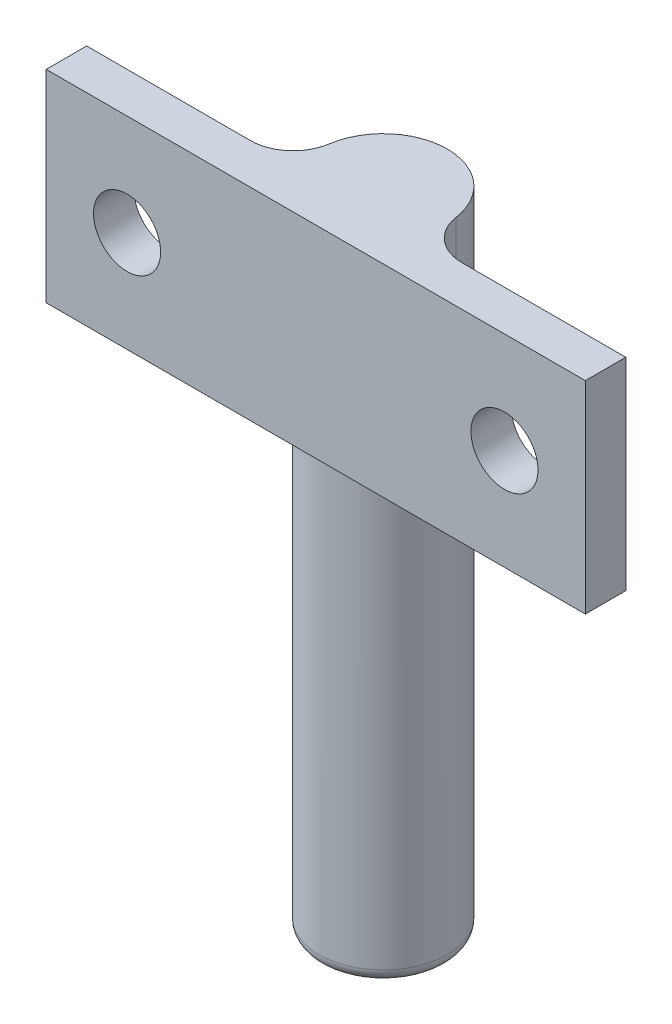
ISO-10303-21;
HEADER;
FILE_DESCRIPTION(('STEP AP214'),'2;1');
FILE_NAME('part.step','',(''),(''),'','','');
FILE_SCHEMA(('AUTOMOTIVE_DESIGN { 1 0 10303 214 1 1 1 1 }'));
ENDSEC;
DATA;
#1=APPLICATION_CONTEXT('core data for automotive mechanical design processes');
#2=APPLICATION_PROTOCOL_DEFINITION('international standard','automotive_design',2000,#1);
#3=PRODUCT_CONTEXT('',#1,'mechanical');
#4=PRODUCT('Part','Part','',(#3));
#5=PRODUCT_RELATED_PRODUCT_CATEGORY('part','',(#4));
#6=PRODUCT_DEFINITION_FORMATION('','',#4);
#7=PRODUCT_DEFINITION_CONTEXT('part definition',#1,'design');
#8=PRODUCT_DEFINITION('design','',#6,#7);
#9=PRODUCT_DEFINITION_SHAPE('','',#8);
#10=(LENGTH_UNIT() NAMED_UNIT(*) SI_UNIT(.MILLI.,.METRE.));
#11=(NAMED_UNIT(*) PLANE_ANGLE_UNIT() SI_UNIT($,.RADIAN.));
#12=(NAMED_UNIT(*) SI_UNIT($,.STERADIAN.) SOLID_ANGLE_UNIT());
#13=UNCERTAINTY_MEASURE_WITH_UNIT(LENGTH_MEASURE(1.E-05),#10,'distance_accuracy_value','');
#14=(GEOMETRIC_REPRESENTATION_CONTEXT(3) GLOBAL_UNCERTAINTY_ASSIGNED_CONTEXT((#13)) GLOBAL_UNIT_ASSIGNED_CONTEXT((#10,
#11,#12)) REPRESENTATION_CONTEXT('',''));
#15=CARTESIAN_POINT('',(0.,0.,0.));
#16=DIRECTION('',(0.,0.,1.));
#17=DIRECTION('',(1.,0.,0.));
#18=AXIS2_PLACEMENT_3D('',#15,#16,#17);
#19=CARTESIAN_POINT('',(0.,0.,-5.));
#20=DIRECTION('',(0.,1.,0.));
#21=DIRECTION('',(0.,0.,1.));
#22=AXIS2_PLACEMENT_3D('',#19,#20,#21);
#23=PLANE('',#22);
#24=CARTESIAN_POINT('',(0.,0.,-5.));
#25=DIRECTION('',(0.,-1.,0.));
#26=DIRECTION('',(0.,0.,-1.));
#27=AXIS2_PLACEMENT_3D('',#24,#25,#26);
#28=CIRCLE('',#27,4.7625);
#29=CARTESIAN_POINT('',(4.71002985659327,0.,-5.705));
#30=VERTEX_POINT('',#29);
#31=CARTESIAN_POINT('',(-4.71002985659327,0.,-5.705));
#32=VERTEX_POINT('',#31);
#33=EDGE_CURVE('E97',#30,#32,#28,.T.);
#34=ORIENTED_EDGE('',*,*,#33,.F.);
#35=CARTESIAN_POINT('',(7.85004976098878,0.,-6.17500000000001));
#36=DIRECTION('',(0.,1.,0.));
#37=DIRECTION('',(0.,0.,1.));
#38=AXIS2_PLACEMENT_3D('',#35,#36,#37);
#39=CIRCLE('',#38,3.175);
#40=CARTESIAN_POINT('',(7.85004976098878,0.,-3.00000000000001));
#41=VERTEX_POINT('',#40);
#42=EDGE_CURVE('E55',#30,#41,#39,.T.);
#43=ORIENTED_EDGE('',*,*,#42,.T.);
#44=DIRECTION('',(-1.,0.,0.));
#45=VECTOR('',#44,1.);
#46=CARTESIAN_POINT('',(4.32219923765668,0.,-3.00000000000001));
#47=LINE('',#46,#45);
#48=CARTESIAN_POINT('',(20.,0.,-3.00000000000001));
#49=VERTEX_POINT('',#48);
#50=EDGE_CURVE('E163',#49,#41,#47,.T.);
#51=ORIENTED_EDGE('',*,*,#50,.F.);
#52=DIRECTION('',(0.,0.,-1.));
#53=VECTOR('',#52,1.);
#54=CARTESIAN_POINT('',(20.,0.,-3.00000000000001));
#55=LINE('',#54,#53);
#56=CARTESIAN_POINT('',(20.,0.,0.));
#57=VERTEX_POINT('',#56);
#58=EDGE_CURVE('E161',#57,#49,#55,.T.);
#59=ORIENTED_EDGE('',*,*,#58,.F.);
#60=DIRECTION('',(1.,0.,0.));
#61=VECTOR('',#60,1.);
#62=CARTESIAN_POINT('',(-20.,0.,0.));
#63=LINE('',#62,#61);
#64=CARTESIAN_POINT('',(-20.,0.,0.));
#65=VERTEX_POINT('',#64);
#66=EDGE_CURVE('E159',#65,#57,#63,.T.);
#67=ORIENTED_EDGE('',*,*,#66,.F.);
#68=DIRECTION('',(0.,0.,1.));
#69=VECTOR('',#68,1.);
#70=CARTESIAN_POINT('',(-20.,0.,-3.));
#71=LINE('',#70,#69);
#72=CARTESIAN_POINT('',(-20.,0.,-3.));
#73=VERTEX_POINT('',#72);
#74=EDGE_CURVE('E103',#73,#65,#71,.T.);
#75=ORIENTED_EDGE('',*,*,#74,.F.);
#76=DIRECTION('',(-1.,0.,0.));
#77=VECTOR('',#76,1.);
#78=CARTESIAN_POINT('',(-20.,0.,-3.));
#79=LINE('',#78,#77);
#80=CARTESIAN_POINT('',(-7.85004976098878,0.,-3.));
#81=VERTEX_POINT('',#80);
#82=EDGE_CURVE('E147',#81,#73,#79,.T.);
#83=ORIENTED_EDGE('',*,*,#82,.F.);
#84=CARTESIAN_POINT('',(-7.85004976098878,0.,-6.175));
#85=DIRECTION('',(0.,1.,0.));
#86=DIRECTION('',(0.,0.,1.));
#87=AXIS2_PLACEMENT_3D('',#84,#85,#86);
#88=CIRCLE('',#87,3.175);
#89=EDGE_CURVE('E99',#81,#32,#88,.T.);
#90=ORIENTED_EDGE('',*,*,#89,.T.);
#91=EDGE_LOOP('',(#34,#43,#51,#59,#67,#75,#83,#90));
#92=FACE_BOUND('',#91,.T.);
#93=ADVANCED_FACE('F32',(#92),#23,.F.);
#94=CARTESIAN_POINT('',(-20.,15.,-3.));
#95=DIRECTION('',(1.,0.,0.));
#96=DIRECTION('',(0.,0.,-1.));
#97=AXIS2_PLACEMENT_3D('',#94,#95,#96);
#98=PLANE('',#97);
#99=ORIENTED_EDGE('',*,*,#74,.T.);
#100=DIRECTION('',(0.,-1.,0.));
#101=VECTOR('',#100,1.);
#102=CARTESIAN_POINT('',(-20.,15.,0.));
#103=LINE('',#102,#101);
#104=CARTESIAN_POINT('',(-20.,15.,0.));
#105=VERTEX_POINT('',#104);
#106=EDGE_CURVE('E123',#105,#65,#103,.T.);
#107=ORIENTED_EDGE('',*,*,#106,.F.);
#108=DIRECTION('',(0.,0.,1.));
#109=VECTOR('',#108,1.);
#110=CARTESIAN_POINT('',(-20.,15.,-3.));
#111=LINE('',#110,#109);
#112=CARTESIAN_POINT('',(-20.,15.,-3.));
#113=VERTEX_POINT('',#112);
#114=EDGE_CURVE('E143',#113,#105,#111,.T.);
#115=ORIENTED_EDGE('',*,*,#114,.F.);
#116=DIRECTION('',(0.,-1.,0.));
#117=VECTOR('',#116,1.);
#118=CARTESIAN_POINT('',(-20.,15.,-3.));
#119=LINE('',#118,#117);
#120=EDGE_CURVE('E156',#113,#73,#119,.T.);
#121=ORIENTED_EDGE('',*,*,#120,.T.);
#122=EDGE_LOOP('',(#99,#107,#115,#121));
#123=FACE_BOUND('',#122,.T.);
#124=ADVANCED_FACE('F195',(#123),#98,.F.);
#125=CARTESIAN_POINT('',(-20.,15.,0.));
#126=DIRECTION('',(0.,0.,-1.));
#127=DIRECTION('',(-1.,0.,0.));
#128=AXIS2_PLACEMENT_3D('',#125,#126,#127);
#129=PLANE('',#128);
#130=CARTESIAN_POINT('',(-14.,7.5,0.));
#131=DIRECTION('',(0.,0.,-1.));
#132=DIRECTION('',(-1.,0.,0.));
#133=AXIS2_PLACEMENT_3D('',#130,#131,#132);
#134=CIRCLE('',#133,2.4892);
#135=CARTESIAN_POINT('',(-16.4892,7.5,0.));
#136=VERTEX_POINT('',#135);
#137=EDGE_CURVE('E225',#136,#136,#134,.T.);
#138=ORIENTED_EDGE('',*,*,#137,.T.);
#139=EDGE_LOOP('',(#138));
#140=FACE_BOUND('',#139,.T.);
#141=CARTESIAN_POINT('',(14.,7.5,0.));
#142=DIRECTION('',(0.,0.,-1.));
#143=DIRECTION('',(-1.,0.,0.));
#144=AXIS2_PLACEMENT_3D('',#141,#142,#143);
#145=CIRCLE('',#144,2.4892);
#146=CARTESIAN_POINT('',(11.5108,7.5,0.));
#147=VERTEX_POINT('',#146);
#148=EDGE_CURVE('E104',#147,#147,#145,.T.);
#149=ORIENTED_EDGE('',*,*,#148,.T.);
#150=EDGE_LOOP('',(#149));
#151=FACE_BOUND('',#150,.T.);
#152=ORIENTED_EDGE('',*,*,#66,.T.);
#153=DIRECTION('',(0.,-1.,0.));
#154=VECTOR('',#153,1.);
#155=CARTESIAN_POINT('',(20.,15.,0.));
#156=LINE('',#155,#154);
#157=CARTESIAN_POINT('',(20.,15.,0.));
#158=VERTEX_POINT('',#157);
#159=EDGE_CURVE('E171',#158,#57,#156,.T.);
#160=ORIENTED_EDGE('',*,*,#159,.F.);
#161=DIRECTION('',(1.,0.,0.));
#162=VECTOR('',#161,1.);
#163=CARTESIAN_POINT('',(-20.,15.,0.));
#164=LINE('',#163,#162);
#165=EDGE_CURVE('E146',#105,#158,#164,.T.);
#166=ORIENTED_EDGE('',*,*,#165,.F.);
#167=ORIENTED_EDGE('',*,*,#106,.T.);
#168=EDGE_LOOP('',(#152,#160,#166,#167));
#169=FACE_BOUND('',#168,.T.);
#170=ADVANCED_FACE('F200',(#140,#151,#169),#129,.F.);
#171=CARTESIAN_POINT('',(20.,15.,-3.00000000000001));
#172=DIRECTION('',(-1.,0.,0.));
#173=DIRECTION('',(0.,0.,1.));
#174=AXIS2_PLACEMENT_3D('',#171,#172,#173);
#175=PLANE('',#174);
#176=ORIENTED_EDGE('',*,*,#58,.T.);
#177=DIRECTION('',(0.,-1.,0.));
#178=VECTOR('',#177,1.);
#179=CARTESIAN_POINT('',(20.,15.,-3.00000000000001));
#180=LINE('',#179,#178);
#181=CARTESIAN_POINT('',(20.,15.,-3.00000000000001));
#182=VERTEX_POINT('',#181);
#183=EDGE_CURVE('E168',#182,#49,#180,.T.);
#184=ORIENTED_EDGE('',*,*,#183,.F.);
#185=DIRECTION('',(0.,0.,-1.));
#186=VECTOR('',#185,1.);
#187=CARTESIAN_POINT('',(20.,15.,-3.00000000000001));
#188=LINE('',#187,#186);
#189=EDGE_CURVE('E149',#158,#182,#188,.T.);
#190=ORIENTED_EDGE('',*,*,#189,.F.);
#191=ORIENTED_EDGE('',*,*,#159,.T.);
#192=EDGE_LOOP('',(#176,#184,#190,#191));
#193=FACE_BOUND('',#192,.T.);
#194=ADVANCED_FACE('F213',(#193),#175,.F.);
#195=CARTESIAN_POINT('',(4.32219923765668,15.,-3.00000000000001));
#196=DIRECTION('',(0.,0.,1.));
#197=DIRECTION('',(1.,0.,0.));
#198=AXIS2_PLACEMENT_3D('',#195,#196,#197);
#199=PLANE('',#198);
#200=CARTESIAN_POINT('',(14.,7.5,-3.00000000000001));
#201=DIRECTION('',(0.,0.,-1.));
#202=DIRECTION('',(-1.,0.,0.));
#203=AXIS2_PLACEMENT_3D('',#200,#201,#202);
#204=CIRCLE('',#203,2.4892);
#205=CARTESIAN_POINT('',(11.5108,7.5,-3.00000000000001));
#206=VERTEX_POINT('',#205);
#207=EDGE_CURVE('E236',#206,#206,#204,.T.);
#208=ORIENTED_EDGE('',*,*,#207,.F.);
#209=EDGE_LOOP('',(#208));
#210=FACE_BOUND('',#209,.T.);
#211=ORIENTED_EDGE('',*,*,#50,.T.);
#212=DIRECTION('',(0.,1.,0.));
#213=VECTOR('',#212,1.);
#214=CARTESIAN_POINT('',(7.85004976098878,15.,-3.00000000000001));
#215=LINE('',#214,#213);
#216=CARTESIAN_POINT('',(7.85004976098878,15.,-3.00000000000001));
#217=VERTEX_POINT('',#216);
#218=EDGE_CURVE('E47',#41,#217,#215,.T.);
#219=ORIENTED_EDGE('',*,*,#218,.T.);
#220=DIRECTION('',(-1.,0.,0.));
#221=VECTOR('',#220,1.);
#222=CARTESIAN_POINT('',(4.32219923765668,15.,-3.00000000000001));
#223=LINE('',#222,#221);
#224=EDGE_CURVE('E151',#182,#217,#223,.T.);
#225=ORIENTED_EDGE('',*,*,#224,.F.);
#226=ORIENTED_EDGE('',*,*,#183,.T.);
#227=EDGE_LOOP('',(#211,#219,#225,#226));
#228=FACE_BOUND('',#227,.T.);
#229=ADVANCED_FACE('F209',(#210,#228),#199,.F.);
#230=CARTESIAN_POINT('',(0.,15.,-5.));
#231=DIRECTION('',(0.,-1.,0.));
#232=DIRECTION('',(0.,0.,-1.));
#233=AXIS2_PLACEMENT_3D('',#230,#231,#232);
#234=CYLINDRICAL_SURFACE('',#233,4.7625);
#235=CARTESIAN_POINT('',(0.,-32.,-5.));
#236=DIRECTION('',(0.,-1.,0.));
#237=DIRECTION('',(0.,0.,-1.));
#238=AXIS2_PLACEMENT_3D('',#235,#236,#237);
#239=CIRCLE('',#238,4.7625);
#240=CARTESIAN_POINT('',(0.,-32.,-9.7625));
#241=VERTEX_POINT('',#240);
#242=EDGE_CURVE('E11',#241,#241,#239,.F.);
#243=ORIENTED_EDGE('',*,*,#242,.T.);
#244=EDGE_LOOP('',(#243));
#245=FACE_BOUND('',#244,.T.);
#246=DIRECTION('',(0.,-1.,0.));
#247=VECTOR('',#246,1.);
#248=CARTESIAN_POINT('',(4.71002985659327,15.,-5.705));
#249=LINE('',#248,#247);
#250=CARTESIAN_POINT('',(4.71002985659327,15.,-5.705));
#251=VERTEX_POINT('',#250);
#252=EDGE_CURVE('E110',#251,#30,#249,.T.);
#253=ORIENTED_EDGE('',*,*,#252,.T.);
#254=ORIENTED_EDGE('',*,*,#33,.T.);
#255=DIRECTION('',(0.,-1.,0.));
#256=VECTOR('',#255,1.);
#257=CARTESIAN_POINT('',(-4.71002985659327,15.,-5.705));
#258=LINE('',#257,#256);
#259=CARTESIAN_POINT('',(-4.71002985659327,15.,-5.705));
#260=VERTEX_POINT('',#259);
#261=EDGE_CURVE('E118',#32,#260,#258,.F.);
#262=ORIENTED_EDGE('',*,*,#261,.T.);
#263=CARTESIAN_POINT('',(0.,15.,-5.));
#264=DIRECTION('',(0.,1.,0.));
#265=DIRECTION('',(0.,0.,1.));
#266=AXIS2_PLACEMENT_3D('',#263,#264,#265);
#267=CIRCLE('',#266,4.7625);
#268=EDGE_CURVE('E117',#251,#260,#267,.T.);
#269=ORIENTED_EDGE('',*,*,#268,.F.);
#270=EDGE_LOOP('',(#253,#254,#262,#269));
#271=FACE_BOUND('',#270,.T.);
#272=ADVANCED_FACE('F115',(#245,#271),#234,.T.);
#273=CARTESIAN_POINT('',(-20.,15.,-3.));
#274=DIRECTION('',(0.,0.,1.));
#275=DIRECTION('',(1.,0.,0.));
#276=AXIS2_PLACEMENT_3D('',#273,#274,#275);
#277=PLANE('',#276);
#278=CARTESIAN_POINT('',(-14.,7.5,-3.));
#279=DIRECTION('',(0.,0.,-1.));
#280=DIRECTION('',(-1.,0.,0.));
#281=AXIS2_PLACEMENT_3D('',#278,#279,#280);
#282=CIRCLE('',#281,2.4892);
#283=CARTESIAN_POINT('',(-16.4892,7.5,-3.));
#284=VERTEX_POINT('',#283);
#285=EDGE_CURVE('E240',#284,#284,#282,.T.);
#286=ORIENTED_EDGE('',*,*,#285,.F.);
#287=EDGE_LOOP('',(#286));
#288=FACE_BOUND('',#287,.T.);
#289=DIRECTION('',(-1.,0.,0.));
#290=VECTOR('',#289,1.);
#291=CARTESIAN_POINT('',(-20.,15.,-3.));
#292=LINE('',#291,#290);
#293=CARTESIAN_POINT('',(-7.85004976098878,15.,-3.));
#294=VERTEX_POINT('',#293);
#295=EDGE_CURVE('E154',#294,#113,#292,.T.);
#296=ORIENTED_EDGE('',*,*,#295,.F.);
#297=DIRECTION('',(0.,1.,0.));
#298=VECTOR('',#297,1.);
#299=CARTESIAN_POINT('',(-7.85004976098878,0.,-3.));
#300=LINE('',#299,#298);
#301=EDGE_CURVE('E119',#294,#81,#300,.F.);
#302=ORIENTED_EDGE('',*,*,#301,.T.);
#303=ORIENTED_EDGE('',*,*,#82,.T.);
#304=ORIENTED_EDGE('',*,*,#120,.F.);
#305=EDGE_LOOP('',(#296,#302,#303,#304));
#306=FACE_BOUND('',#305,.T.);
#307=ADVANCED_FACE('F182',(#288,#306),#277,.F.);
#308=CARTESIAN_POINT('',(0.,15.,-5.));
#309=DIRECTION('',(0.,1.,0.));
#310=DIRECTION('',(0.,0.,1.));
#311=AXIS2_PLACEMENT_3D('',#308,#309,#310);
#312=PLANE('',#311);
#313=ORIENTED_EDGE('',*,*,#114,.T.);
#314=ORIENTED_EDGE('',*,*,#165,.T.);
#315=ORIENTED_EDGE('',*,*,#189,.T.);
#316=ORIENTED_EDGE('',*,*,#224,.T.);
#317=CARTESIAN_POINT('',(7.85004976098878,15.,-6.17500000000001));
#318=DIRECTION('',(0.,1.,0.));
#319=DIRECTION('',(0.,0.,1.));
#320=AXIS2_PLACEMENT_3D('',#317,#318,#319);
#321=CIRCLE('',#320,3.175);
#322=EDGE_CURVE('E111',#217,#251,#321,.F.);
#323=ORIENTED_EDGE('',*,*,#322,.T.);
#324=ORIENTED_EDGE('',*,*,#268,.T.);
#325=CARTESIAN_POINT('',(-7.85004976098878,15.,-6.175));
#326=DIRECTION('',(0.,1.,0.));
#327=DIRECTION('',(0.,0.,1.));
#328=AXIS2_PLACEMENT_3D('',#325,#326,#327);
#329=CIRCLE('',#328,3.175);
#330=EDGE_CURVE('E112',#260,#294,#329,.F.);
#331=ORIENTED_EDGE('',*,*,#330,.T.);
#332=ORIENTED_EDGE('',*,*,#295,.T.);
#333=EDGE_LOOP('',(#313,#314,#315,#316,#323,#324,#331,#332));
#334=FACE_BOUND('',#333,.T.);
#335=ADVANCED_FACE('F177',(#334),#312,.T.);
#336=CARTESIAN_POINT('',(-7.85004976098878,15.,-6.175));
#337=DIRECTION('',(0.,-1.,0.));
#338=DIRECTION('',(0.,0.,-1.));
#339=AXIS2_PLACEMENT_3D('',#336,#337,#338);
#340=CYLINDRICAL_SURFACE('',#339,3.175);
#341=ORIENTED_EDGE('',*,*,#330,.F.);
#342=ORIENTED_EDGE('',*,*,#261,.F.);
#343=ORIENTED_EDGE('',*,*,#89,.F.);
#344=ORIENTED_EDGE('',*,*,#301,.F.);
#345=EDGE_LOOP('',(#341,#342,#343,#344));
#346=FACE_BOUND('',#345,.T.);
#347=ADVANCED_FACE('F184',(#346),#340,.F.);
#348=CARTESIAN_POINT('',(7.85004976098878,15.,-6.17500000000001));
#349=DIRECTION('',(0.,-1.,0.));
#350=DIRECTION('',(0.,0.,-1.));
#351=AXIS2_PLACEMENT_3D('',#348,#349,#350);
#352=CYLINDRICAL_SURFACE('',#351,3.175);
#353=ORIENTED_EDGE('',*,*,#322,.F.);
#354=ORIENTED_EDGE('',*,*,#218,.F.);
#355=ORIENTED_EDGE('',*,*,#42,.F.);
#356=ORIENTED_EDGE('',*,*,#252,.F.);
#357=EDGE_LOOP('',(#353,#354,#355,#356));
#358=FACE_BOUND('',#357,.T.);
#359=ADVANCED_FACE('F109',(#358),#352,.F.);
#360=CARTESIAN_POINT('',(0.,-33.,-5.));
#361=DIRECTION('',(0.,-1.,0.));
#362=DIRECTION('',(0.,0.,-1.));
#363=AXIS2_PLACEMENT_3D('',#360,#361,#362);
#364=PLANE('',#363);
#365=CARTESIAN_POINT('',(0.,-33.,-5.));
#366=DIRECTION('',(0.,-1.,0.));
#367=DIRECTION('',(0.,0.,-1.));
#368=AXIS2_PLACEMENT_3D('',#365,#366,#367);
#369=CIRCLE('',#368,3.7625);
#370=CARTESIAN_POINT('',(0.,-33.,-8.7625));
#371=VERTEX_POINT('',#370);
#372=EDGE_CURVE('E40',#371,#371,#369,.T.);
#373=ORIENTED_EDGE('',*,*,#372,.T.);
#374=EDGE_LOOP('',(#373));
#375=FACE_BOUND('',#374,.T.);
#376=ADVANCED_FACE('F191',(#375),#364,.T.);
#377=CARTESIAN_POINT('',(0.,-32.,-5.));
#378=DIRECTION('',(0.,-1.,0.));
#379=DIRECTION('',(0.,0.,-1.));
#380=AXIS2_PLACEMENT_3D('',#377,#378,#379);
#381=TOROIDAL_SURFACE('',#380,3.7625,1.);
#382=ORIENTED_EDGE('',*,*,#242,.F.);
#383=EDGE_LOOP('',(#382));
#384=FACE_BOUND('',#383,.T.);
#385=ORIENTED_EDGE('',*,*,#372,.F.);
#386=EDGE_LOOP('',(#385));
#387=FACE_BOUND('',#386,.T.);
#388=ADVANCED_FACE('F34',(#384,#387),#381,.T.);
#389=CARTESIAN_POINT('',(14.,7.5,-3.00000000000001));
#390=DIRECTION('',(0.,0.,-1.));
#391=DIRECTION('',(-1.,0.,0.));
#392=AXIS2_PLACEMENT_3D('',#389,#390,#391);
#393=CYLINDRICAL_SURFACE('',#392,2.4892);
#394=ORIENTED_EDGE('',*,*,#148,.F.);
#395=EDGE_LOOP('',(#394));
#396=FACE_BOUND('',#395,.T.);
#397=ORIENTED_EDGE('',*,*,#207,.T.);
#398=EDGE_LOOP('',(#397));
#399=FACE_BOUND('',#398,.T.);
#400=ADVANCED_FACE('F248',(#396,#399),#393,.F.);
#401=CARTESIAN_POINT('',(-14.,7.5,-3.));
#402=DIRECTION('',(0.,0.,-1.));
#403=DIRECTION('',(-1.,0.,0.));
#404=AXIS2_PLACEMENT_3D('',#401,#402,#403);
#405=CYLINDRICAL_SURFACE('',#404,2.4892);
#406=ORIENTED_EDGE('',*,*,#137,.F.);
#407=EDGE_LOOP('',(#406));
#408=FACE_BOUND('',#407,.T.);
#409=ORIENTED_EDGE('',*,*,#285,.T.);
#410=EDGE_LOOP('',(#409));
#411=FACE_BOUND('',#410,.T.);
#412=ADVANCED_FACE('F246',(#408,#411),#405,.F.);
#413=CLOSED_SHELL('',(#93,#124,#170,#194,#229,#272,#307,#335,#347,#359,#376,#388,#400,#412));
#414=MANIFOLD_SOLID_BREP('B2',#413);
#415=ADVANCED_BREP_SHAPE_REPRESENTATION('',(#18,#414),#14);
#416=SHAPE_DEFINITION_REPRESENTATION(#9,#415);
ENDSEC;
END-ISO-10303-21;
